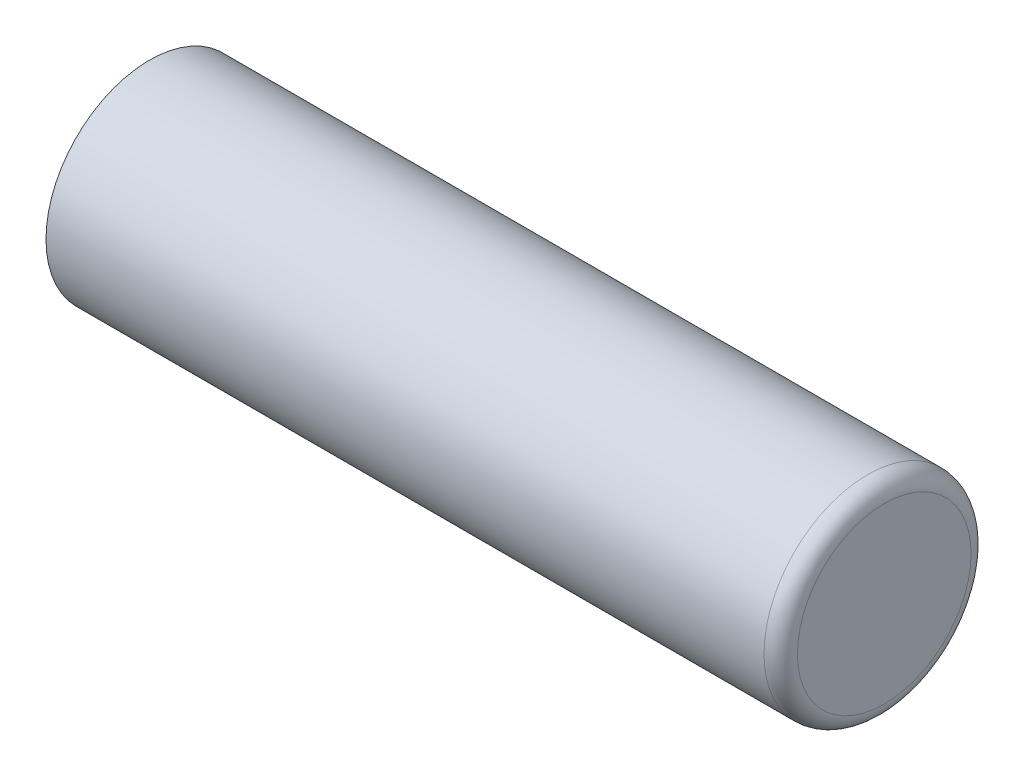
ISO-10303-21;
HEADER;
FILE_DESCRIPTION(('STEP AP214'),'2;1');
FILE_NAME('part.step','',(''),(''),'','','');
FILE_SCHEMA(('AUTOMOTIVE_DESIGN { 1 0 10303 214 1 1 1 1 }'));
ENDSEC;
DATA;
#1=APPLICATION_CONTEXT('core data for automotive mechanical design processes');
#2=APPLICATION_PROTOCOL_DEFINITION('international standard','automotive_design',2000,#1);
#3=PRODUCT_CONTEXT('',#1,'mechanical');
#4=PRODUCT('Part','Part','',(#3));
#5=PRODUCT_RELATED_PRODUCT_CATEGORY('part','',(#4));
#6=PRODUCT_DEFINITION_FORMATION('','',#4);
#7=PRODUCT_DEFINITION_CONTEXT('part definition',#1,'design');
#8=PRODUCT_DEFINITION('design','',#6,#7);
#9=PRODUCT_DEFINITION_SHAPE('','',#8);
#10=(LENGTH_UNIT() NAMED_UNIT(*) SI_UNIT(.MILLI.,.METRE.));
#11=(NAMED_UNIT(*) PLANE_ANGLE_UNIT() SI_UNIT($,.RADIAN.));
#12=(NAMED_UNIT(*) SI_UNIT($,.STERADIAN.) SOLID_ANGLE_UNIT());
#13=UNCERTAINTY_MEASURE_WITH_UNIT(LENGTH_MEASURE(1.E-05),#10,'distance_accuracy_value','');
#14=(GEOMETRIC_REPRESENTATION_CONTEXT(3) GLOBAL_UNCERTAINTY_ASSIGNED_CONTEXT((#13)) GLOBAL_UNIT_ASSIGNED_CONTEXT((#10,
#11,#12)) REPRESENTATION_CONTEXT('',''));
#15=CARTESIAN_POINT('',(0.,0.,0.));
#16=DIRECTION('',(0.,0.,1.));
#17=DIRECTION('',(1.,0.,0.));
#18=AXIS2_PLACEMENT_3D('',#15,#16,#17);
#19=CARTESIAN_POINT('',(11.,0.,-2.60000000000001));
#20=DIRECTION('',(-1.,0.,0.));
#21=DIRECTION('',(0.,0.,1.));
#22=AXIS2_PLACEMENT_3D('',#19,#20,#21);
#23=PLANE('',#22);
#24=CARTESIAN_POINT('',(11.,0.,0.));
#25=DIRECTION('',(-1.,0.,0.));
#26=DIRECTION('',(0.,0.,1.));
#27=AXIS2_PLACEMENT_3D('',#24,#25,#26);
#28=CIRCLE('',#27,2.60000000000001);
#29=CARTESIAN_POINT('',(11.,0.,2.60000000000001));
#30=VERTEX_POINT('',#29);
#31=EDGE_CURVE('E41',#30,#30,#28,.T.);
#32=ORIENTED_EDGE('',*,*,#31,.F.);
#33=EDGE_LOOP('',(#32));
#34=FACE_BOUND('',#33,.T.);
#35=ADVANCED_FACE('F31',(#34),#23,.F.);
#36=CARTESIAN_POINT('',(-11.,0.,-3.10000000000001));
#37=DIRECTION('',(1.,0.,0.));
#38=DIRECTION('',(0.,0.,-1.));
#39=AXIS2_PLACEMENT_3D('',#36,#37,#38);
#40=PLANE('',#39);
#41=CARTESIAN_POINT('',(-11.,0.,0.));
#42=DIRECTION('',(-1.,0.,0.));
#43=DIRECTION('',(0.,0.,1.));
#44=AXIS2_PLACEMENT_3D('',#41,#42,#43);
#45=CIRCLE('',#44,3.10000000000001);
#46=CARTESIAN_POINT('',(-11.,0.,3.10000000000001));
#47=VERTEX_POINT('',#46);
#48=EDGE_CURVE('E10',#47,#47,#45,.T.);
#49=ORIENTED_EDGE('',*,*,#48,.T.);
#50=EDGE_LOOP('',(#49));
#51=FACE_BOUND('',#50,.T.);
#52=ADVANCED_FACE('F51',(#51),#40,.F.);
#53=CARTESIAN_POINT('',(-11.,0.,0.));
#54=DIRECTION('',(-1.,0.,0.));
#55=DIRECTION('',(0.,0.,1.));
#56=AXIS2_PLACEMENT_3D('',#53,#54,#55);
#57=CYLINDRICAL_SURFACE('',#56,3.10000000000001);
#58=ORIENTED_EDGE('',*,*,#48,.F.);
#59=EDGE_LOOP('',(#58));
#60=FACE_BOUND('',#59,.T.);
#61=CARTESIAN_POINT('',(10.5,0.,0.));
#62=DIRECTION('',(-1.,0.,0.));
#63=DIRECTION('',(0.,0.,1.));
#64=AXIS2_PLACEMENT_3D('',#61,#62,#63);
#65=CIRCLE('',#64,3.10000000000001);
#66=CARTESIAN_POINT('',(10.5,0.,3.10000000000001));
#67=VERTEX_POINT('',#66);
#68=EDGE_CURVE('E37',#67,#67,#65,.T.);
#69=ORIENTED_EDGE('',*,*,#68,.T.);
#70=EDGE_LOOP('',(#69));
#71=FACE_BOUND('',#70,.T.);
#72=ADVANCED_FACE('F55',(#60,#71),#57,.T.);
#73=CARTESIAN_POINT('',(10.5,0.,0.));
#74=DIRECTION('',(-1.,0.,0.));
#75=DIRECTION('',(0.,0.,1.));
#76=AXIS2_PLACEMENT_3D('',#73,#74,#75);
#77=TOROIDAL_SURFACE('',#76,2.60000000000001,0.5);
#78=ORIENTED_EDGE('',*,*,#68,.F.);
#79=EDGE_LOOP('',(#78));
#80=FACE_BOUND('',#79,.T.);
#81=ORIENTED_EDGE('',*,*,#31,.T.);
#82=EDGE_LOOP('',(#81));
#83=FACE_BOUND('',#82,.T.);
#84=ADVANCED_FACE('F48',(#80,#83),#77,.T.);
#85=CLOSED_SHELL('',(#35,#52,#72,#84));
#86=MANIFOLD_SOLID_BREP('B2',#85);
#87=ADVANCED_BREP_SHAPE_REPRESENTATION('',(#18,#86),#14);
#88=SHAPE_DEFINITION_REPRESENTATION(#9,#87);
ENDSEC;
END-ISO-10303-21;
